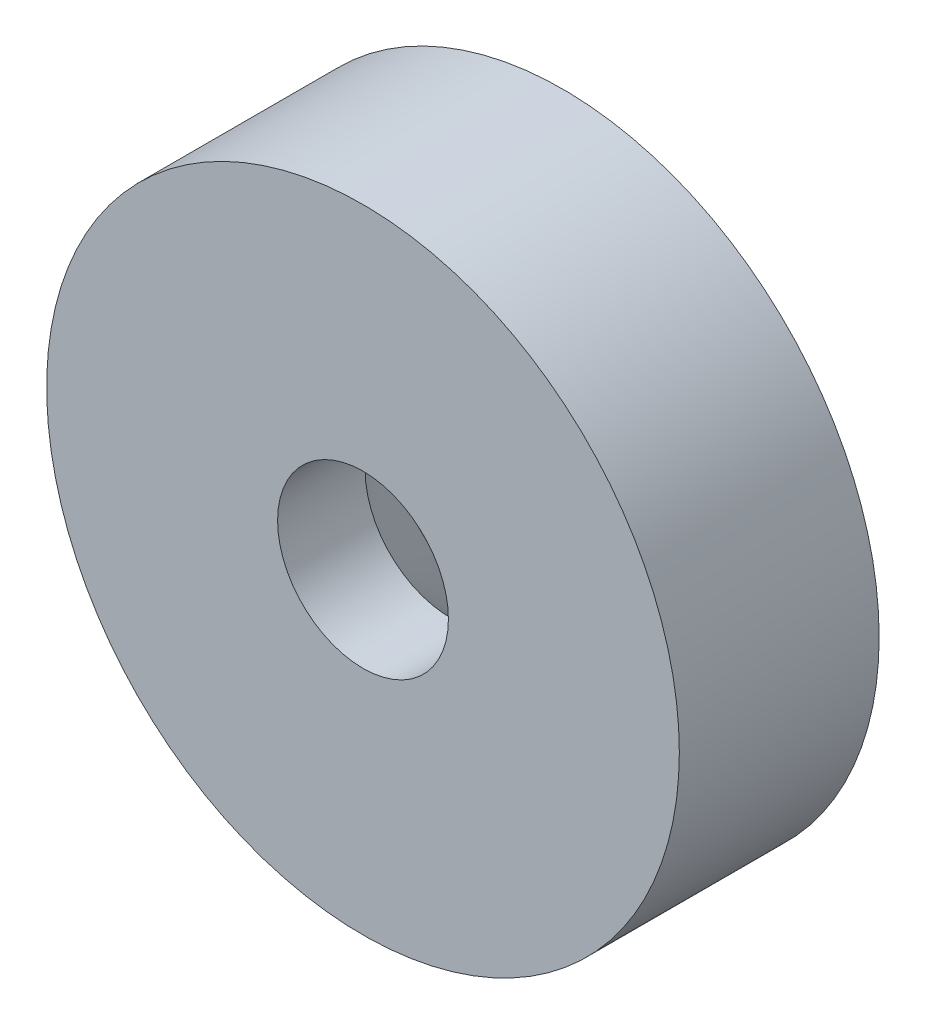
ISO-10303-21;
HEADER;
FILE_DESCRIPTION(('STEP AP214'),'2;1');
FILE_NAME('part.step','',(''),(''),'','','');
FILE_SCHEMA(('AUTOMOTIVE_DESIGN { 1 0 10303 214 1 1 1 1 }'));
ENDSEC;
DATA;
#1=APPLICATION_CONTEXT('core data for automotive mechanical design processes');
#2=APPLICATION_PROTOCOL_DEFINITION('international standard','automotive_design',2000,#1);
#3=PRODUCT_CONTEXT('',#1,'mechanical');
#4=PRODUCT('Part','Part','',(#3));
#5=PRODUCT_RELATED_PRODUCT_CATEGORY('part','',(#4));
#6=PRODUCT_DEFINITION_FORMATION('','',#4);
#7=PRODUCT_DEFINITION_CONTEXT('part definition',#1,'design');
#8=PRODUCT_DEFINITION('design','',#6,#7);
#9=PRODUCT_DEFINITION_SHAPE('','',#8);
#10=(LENGTH_UNIT() NAMED_UNIT(*) SI_UNIT(.MILLI.,.METRE.));
#11=(NAMED_UNIT(*) PLANE_ANGLE_UNIT() SI_UNIT($,.RADIAN.));
#12=(NAMED_UNIT(*) SI_UNIT($,.STERADIAN.) SOLID_ANGLE_UNIT());
#13=UNCERTAINTY_MEASURE_WITH_UNIT(LENGTH_MEASURE(1.E-05),#10,'distance_accuracy_value','');
#14=(GEOMETRIC_REPRESENTATION_CONTEXT(3) GLOBAL_UNCERTAINTY_ASSIGNED_CONTEXT((#13)) GLOBAL_UNIT_ASSIGNED_CONTEXT((#10,
#11,#12)) REPRESENTATION_CONTEXT('',''));
#15=CARTESIAN_POINT('',(0.,0.,0.));
#16=DIRECTION('',(0.,0.,1.));
#17=DIRECTION('',(1.,0.,0.));
#18=AXIS2_PLACEMENT_3D('',#15,#16,#17);
#19=CARTESIAN_POINT('',(5.05628521189009,23.0789914296533,3.79));
#20=DIRECTION('',(0.,0.,1.));
#21=DIRECTION('',(1.,0.,0.));
#22=AXIS2_PLACEMENT_3D('',#19,#20,#21);
#23=PLANE('',#22);
#24=CARTESIAN_POINT('',(5.05628521189009,23.0789914296533,3.79));
#25=DIRECTION('',(0.,0.,1.));
#26=DIRECTION('',(1.,0.,0.));
#27=AXIS2_PLACEMENT_3D('',#24,#25,#26);
#28=CIRCLE('',#27,6.);
#29=CARTESIAN_POINT('',(11.0562852118901,23.0789914296533,3.79));
#30=VERTEX_POINT('',#29);
#31=EDGE_CURVE('E10',#30,#30,#28,.T.);
#32=ORIENTED_EDGE('',*,*,#31,.T.);
#33=EDGE_LOOP('',(#32));
#34=FACE_BOUND('',#33,.T.);
#35=CARTESIAN_POINT('',(5.05628521189009,23.0789914296533,3.79));
#36=DIRECTION('',(0.,0.,1.));
#37=DIRECTION('',(1.,0.,0.));
#38=AXIS2_PLACEMENT_3D('',#35,#36,#37);
#39=CIRCLE('',#38,1.62);
#40=CARTESIAN_POINT('',(6.67628521189009,23.0789914296533,3.79));
#41=VERTEX_POINT('',#40);
#42=EDGE_CURVE('E46',#41,#41,#39,.T.);
#43=ORIENTED_EDGE('',*,*,#42,.F.);
#44=EDGE_LOOP('',(#43));
#45=FACE_BOUND('',#44,.T.);
#46=ADVANCED_FACE('F33',(#34,#45),#23,.T.);
#47=CARTESIAN_POINT('',(5.05628521189009,23.0789914296533,0.));
#48=DIRECTION('',(0.,0.,1.));
#49=DIRECTION('',(1.,0.,0.));
#50=AXIS2_PLACEMENT_3D('',#47,#48,#49);
#51=PLANE('',#50);
#52=CARTESIAN_POINT('',(5.05628521189009,23.0789914296533,0.));
#53=DIRECTION('',(0.,0.,-1.));
#54=DIRECTION('',(-1.,0.,0.));
#55=AXIS2_PLACEMENT_3D('',#52,#53,#54);
#56=CIRCLE('',#55,3.75);
#57=CARTESIAN_POINT('',(1.30628521189009,23.0789914296533,0.));
#58=VERTEX_POINT('',#57);
#59=EDGE_CURVE('E50',#58,#58,#56,.T.);
#60=ORIENTED_EDGE('',*,*,#59,.F.);
#61=EDGE_LOOP('',(#60));
#62=FACE_BOUND('',#61,.T.);
#63=CARTESIAN_POINT('',(5.05628521189009,23.0789914296533,0.));
#64=DIRECTION('',(0.,0.,1.));
#65=DIRECTION('',(1.,0.,0.));
#66=AXIS2_PLACEMENT_3D('',#63,#64,#65);
#67=CIRCLE('',#66,6.);
#68=CARTESIAN_POINT('',(11.0562852118901,23.0789914296533,0.));
#69=VERTEX_POINT('',#68);
#70=EDGE_CURVE('E41',#69,#69,#67,.T.);
#71=ORIENTED_EDGE('',*,*,#70,.F.);
#72=EDGE_LOOP('',(#71));
#73=FACE_BOUND('',#72,.T.);
#74=ADVANCED_FACE('F66',(#62,#73),#51,.F.);
#75=CARTESIAN_POINT('',(5.05628521189009,23.0789914296533,3.79));
#76=DIRECTION('',(0.,0.,-1.));
#77=DIRECTION('',(-1.,0.,0.));
#78=AXIS2_PLACEMENT_3D('',#75,#76,#77);
#79=CYLINDRICAL_SURFACE('',#78,6.);
#80=ORIENTED_EDGE('',*,*,#31,.F.);
#81=EDGE_LOOP('',(#80));
#82=FACE_BOUND('',#81,.T.);
#83=ORIENTED_EDGE('',*,*,#70,.T.);
#84=EDGE_LOOP('',(#83));
#85=FACE_BOUND('',#84,.T.);
#86=ADVANCED_FACE('F35',(#82,#85),#79,.T.);
#87=CARTESIAN_POINT('',(5.05628521189009,23.0789914296533,3.79));
#88=DIRECTION('',(0.,0.,-1.));
#89=DIRECTION('',(-1.,0.,0.));
#90=AXIS2_PLACEMENT_3D('',#87,#88,#89);
#91=CYLINDRICAL_SURFACE('',#90,1.62);
#92=CARTESIAN_POINT('',(5.05628521189009,23.0789914296533,2.12999999999999));
#93=DIRECTION('',(0.,0.,-1.));
#94=DIRECTION('',(-1.,0.,0.));
#95=AXIS2_PLACEMENT_3D('',#92,#93,#94);
#96=CIRCLE('',#95,1.62);
#97=CARTESIAN_POINT('',(3.43628521189009,23.0789914296533,2.12999999999999));
#98=VERTEX_POINT('',#97);
#99=EDGE_CURVE('E37',#98,#98,#96,.F.);
#100=ORIENTED_EDGE('',*,*,#99,.F.);
#101=EDGE_LOOP('',(#100));
#102=FACE_BOUND('',#101,.T.);
#103=ORIENTED_EDGE('',*,*,#42,.T.);
#104=EDGE_LOOP('',(#103));
#105=FACE_BOUND('',#104,.T.);
#106=ADVANCED_FACE('F59',(#102,#105),#91,.F.);
#107=CARTESIAN_POINT('',(5.05628521189009,23.0789914296533,0.));
#108=DIRECTION('',(0.,0.,-1.));
#109=DIRECTION('',(-1.,0.,0.));
#110=AXIS2_PLACEMENT_3D('',#107,#108,#109);
#111=CONICAL_SURFACE('',#110,3.75,0.78539816339745);
#112=ORIENTED_EDGE('',*,*,#99,.T.);
#113=EDGE_LOOP('',(#112));
#114=FACE_BOUND('',#113,.T.);
#115=ORIENTED_EDGE('',*,*,#59,.T.);
#116=EDGE_LOOP('',(#115));
#117=FACE_BOUND('',#116,.T.);
#118=ADVANCED_FACE('F57',(#114,#117),#111,.F.);
#119=CLOSED_SHELL('',(#46,#74,#86,#106,#118));
#120=MANIFOLD_SOLID_BREP('B2',#119);
#121=ADVANCED_BREP_SHAPE_REPRESENTATION('',(#18,#120),#14);
#122=SHAPE_DEFINITION_REPRESENTATION(#9,#121);
ENDSEC;
END-ISO-10303-21;
